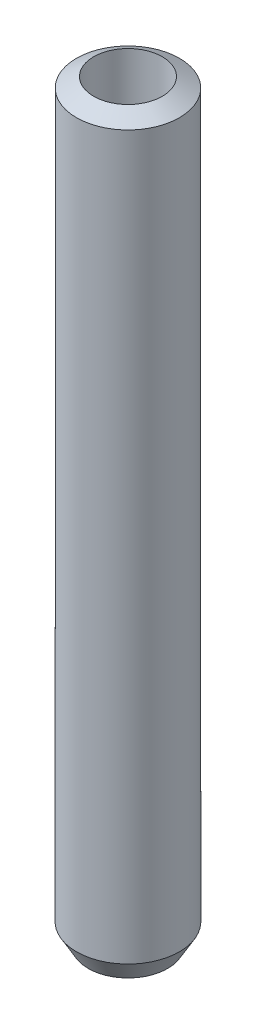
ISO-10303-21;
HEADER;
FILE_DESCRIPTION(('STEP AP214'),'2;1');
FILE_NAME('part.step','',(''),(''),'','','');
FILE_SCHEMA(('AUTOMOTIVE_DESIGN { 1 0 10303 214 1 1 1 1 }'));
ENDSEC;
DATA;
#1=APPLICATION_CONTEXT('core data for automotive mechanical design processes');
#2=APPLICATION_PROTOCOL_DEFINITION('international standard','automotive_design',2000,#1);
#3=PRODUCT_CONTEXT('',#1,'mechanical');
#4=PRODUCT('Part','Part','',(#3));
#5=PRODUCT_RELATED_PRODUCT_CATEGORY('part','',(#4));
#6=PRODUCT_DEFINITION_FORMATION('','',#4);
#7=PRODUCT_DEFINITION_CONTEXT('part definition',#1,'design');
#8=PRODUCT_DEFINITION('design','',#6,#7);
#9=PRODUCT_DEFINITION_SHAPE('','',#8);
#10=(LENGTH_UNIT() NAMED_UNIT(*) SI_UNIT(.MILLI.,.METRE.));
#11=(NAMED_UNIT(*) PLANE_ANGLE_UNIT() SI_UNIT($,.RADIAN.));
#12=(NAMED_UNIT(*) SI_UNIT($,.STERADIAN.) SOLID_ANGLE_UNIT());
#13=UNCERTAINTY_MEASURE_WITH_UNIT(LENGTH_MEASURE(1.E-05),#10,'distance_accuracy_value','');
#14=(GEOMETRIC_REPRESENTATION_CONTEXT(3) GLOBAL_UNCERTAINTY_ASSIGNED_CONTEXT((#13)) GLOBAL_UNIT_ASSIGNED_CONTEXT((#10,
#11,#12)) REPRESENTATION_CONTEXT('',''));
#15=CARTESIAN_POINT('',(0.,0.,0.));
#16=DIRECTION('',(0.,0.,1.));
#17=DIRECTION('',(1.,0.,0.));
#18=AXIS2_PLACEMENT_3D('',#15,#16,#17);
#19=CARTESIAN_POINT('',(0.,329.73576524458,0.));
#20=DIRECTION('',(0.,-1.,0.));
#21=DIRECTION('',(0.,0.,-1.));
#22=AXIS2_PLACEMENT_3D('',#19,#20,#21);
#23=CYLINDRICAL_SURFACE('',#22,22.5);
#24=CARTESIAN_POINT('',(0.,324.587945070876,0.));
#25=DIRECTION('',(0.,1.,0.));
#26=DIRECTION('',(0.,0.,1.));
#27=AXIS2_PLACEMENT_3D('',#24,#25,#26);
#28=CIRCLE('',#27,22.5);
#29=CARTESIAN_POINT('',(0.,324.587945070876,22.5));
#30=VERTEX_POINT('',#29);
#31=EDGE_CURVE('E50',#30,#30,#28,.F.);
#32=ORIENTED_EDGE('',*,*,#31,.T.);
#33=EDGE_LOOP('',(#32));
#34=FACE_BOUND('',#33,.T.);
#35=CARTESIAN_POINT('',(0.,8.91628608908257,0.));
#36=DIRECTION('',(0.,1.,0.));
#37=DIRECTION('',(0.,0.,1.));
#38=AXIS2_PLACEMENT_3D('',#35,#36,#37);
#39=CIRCLE('',#38,22.5);
#40=CARTESIAN_POINT('',(0.,8.91628608908257,22.5));
#41=VERTEX_POINT('',#40);
#42=EDGE_CURVE('E51',#41,#41,#39,.T.);
#43=ORIENTED_EDGE('',*,*,#42,.T.);
#44=EDGE_LOOP('',(#43));
#45=FACE_BOUND('',#44,.T.);
#46=ADVANCED_FACE('F39',(#34,#45),#23,.T.);
#47=CARTESIAN_POINT('',(0.,0.,0.));
#48=DIRECTION('',(0.,1.,0.));
#49=DIRECTION('',(0.,0.,1.));
#50=AXIS2_PLACEMENT_3D('',#47,#48,#49);
#51=PLANE('',#50);
#52=CARTESIAN_POINT('',(0.,0.,0.));
#53=DIRECTION('',(0.,1.,0.));
#54=DIRECTION('',(0.,0.,1.));
#55=AXIS2_PLACEMENT_3D('',#52,#53,#54);
#56=CIRCLE('',#55,17.3521798262964);
#57=CARTESIAN_POINT('',(0.,0.,17.3521798262964));
#58=VERTEX_POINT('',#57);
#59=EDGE_CURVE('E10',#58,#58,#56,.F.);
#60=ORIENTED_EDGE('',*,*,#59,.T.);
#61=EDGE_LOOP('',(#60));
#62=FACE_BOUND('',#61,.T.);
#63=CARTESIAN_POINT('',(0.,0.,0.));
#64=DIRECTION('',(0.,1.,0.));
#65=DIRECTION('',(0.,0.,1.));
#66=AXIS2_PLACEMENT_3D('',#63,#64,#65);
#67=CIRCLE('',#66,14.9958522913518);
#68=CARTESIAN_POINT('',(0.,0.,14.9958522913518));
#69=VERTEX_POINT('',#68);
#70=EDGE_CURVE('E58',#69,#69,#67,.T.);
#71=ORIENTED_EDGE('',*,*,#70,.T.);
#72=EDGE_LOOP('',(#71));
#73=FACE_BOUND('',#72,.T.);
#74=ADVANCED_FACE('F62',(#62,#73),#51,.F.);
#75=CARTESIAN_POINT('',(0.,329.73576524458,0.));
#76=DIRECTION('',(0.,-1.,0.));
#77=DIRECTION('',(0.,0.,-1.));
#78=AXIS2_PLACEMENT_3D('',#75,#76,#77);
#79=CYLINDRICAL_SURFACE('',#78,14.9958522913518);
#80=CARTESIAN_POINT('',(0.,328.920466770503,0.));
#81=DIRECTION('',(0.,-1.,0.));
#82=DIRECTION('',(0.,0.,-1.));
#83=AXIS2_PLACEMENT_3D('',#80,#81,#82);
#84=CIRCLE('',#83,14.9958522913518);
#85=CARTESIAN_POINT('',(0.,328.920466770503,-14.9958522913518));
#86=VERTEX_POINT('',#85);
#87=EDGE_CURVE('E54',#86,#86,#84,.F.);
#88=ORIENTED_EDGE('',*,*,#87,.T.);
#89=EDGE_LOOP('',(#88));
#90=FACE_BOUND('',#89,.T.);
#91=ORIENTED_EDGE('',*,*,#70,.F.);
#92=EDGE_LOOP('',(#91));
#93=FACE_BOUND('',#92,.T.);
#94=ADVANCED_FACE('F68',(#90,#93),#79,.F.);
#95=CARTESIAN_POINT('',(0.,329.73576524458,0.));
#96=DIRECTION('',(0.,-1.,0.));
#97=DIRECTION('',(0.,0.,-1.));
#98=AXIS2_PLACEMENT_3D('',#95,#96,#97);
#99=CONICAL_SURFACE('',#98,13.5837139109173,1.0471975511966);
#100=ORIENTED_EDGE('',*,*,#31,.F.);
#101=EDGE_LOOP('',(#100));
#102=FACE_BOUND('',#101,.T.);
#103=ORIENTED_EDGE('',*,*,#87,.F.);
#104=EDGE_LOOP('',(#103));
#105=FACE_BOUND('',#104,.T.);
#106=ADVANCED_FACE('F66',(#102,#105),#99,.T.);
#107=CARTESIAN_POINT('',(0.,8.91628608908257,0.));
#108=DIRECTION('',(0.,1.,0.));
#109=DIRECTION('',(0.,0.,1.));
#110=AXIS2_PLACEMENT_3D('',#107,#108,#109);
#111=CONICAL_SURFACE('',#110,22.5,0.523598775598303);
#112=ORIENTED_EDGE('',*,*,#59,.F.);
#113=EDGE_LOOP('',(#112));
#114=FACE_BOUND('',#113,.T.);
#115=ORIENTED_EDGE('',*,*,#42,.F.);
#116=EDGE_LOOP('',(#115));
#117=FACE_BOUND('',#116,.T.);
#118=ADVANCED_FACE('F45',(#114,#117),#111,.T.);
#119=CLOSED_SHELL('',(#46,#74,#94,#106,#118));
#120=MANIFOLD_SOLID_BREP('B2',#119);
#121=ADVANCED_BREP_SHAPE_REPRESENTATION('',(#18,#120),#14);
#122=SHAPE_DEFINITION_REPRESENTATION(#9,#121);
ENDSEC;
END-ISO-10303-21;
